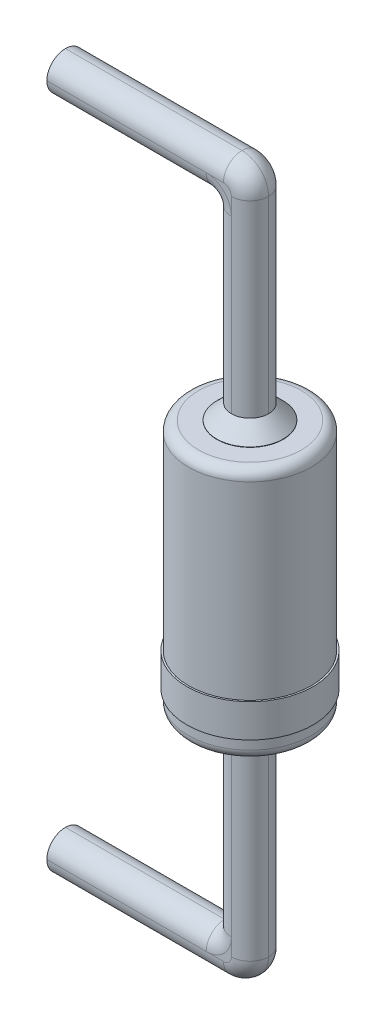
ISO-10303-21;
HEADER;
FILE_DESCRIPTION(('STEP AP214'),'2;1');
FILE_NAME('part.step','',(''),(''),'','','');
FILE_SCHEMA(('AUTOMOTIVE_DESIGN { 1 0 10303 214 1 1 1 1 }'));
ENDSEC;
DATA;
#1=APPLICATION_CONTEXT('core data for automotive mechanical design processes');
#2=APPLICATION_PROTOCOL_DEFINITION('international standard','automotive_design',2000,#1);
#3=PRODUCT_CONTEXT('',#1,'mechanical');
#4=PRODUCT('Part','Part','',(#3));
#5=PRODUCT_RELATED_PRODUCT_CATEGORY('part','',(#4));
#6=PRODUCT_DEFINITION_FORMATION('','',#4);
#7=PRODUCT_DEFINITION_CONTEXT('part definition',#1,'design');
#8=PRODUCT_DEFINITION('design','',#6,#7);
#9=PRODUCT_DEFINITION_SHAPE('','',#8);
#10=(LENGTH_UNIT() NAMED_UNIT(*) SI_UNIT(.MILLI.,.METRE.));
#11=(NAMED_UNIT(*) PLANE_ANGLE_UNIT() SI_UNIT($,.RADIAN.));
#12=(NAMED_UNIT(*) SI_UNIT($,.STERADIAN.) SOLID_ANGLE_UNIT());
#13=UNCERTAINTY_MEASURE_WITH_UNIT(LENGTH_MEASURE(1.E-05),#10,'distance_accuracy_value','');
#14=(GEOMETRIC_REPRESENTATION_CONTEXT(3) GLOBAL_UNCERTAINTY_ASSIGNED_CONTEXT((#13)) GLOBAL_UNIT_ASSIGNED_CONTEXT((#10,
#11,#12)) REPRESENTATION_CONTEXT('',''));
#15=CARTESIAN_POINT('',(0.,0.,0.));
#16=DIRECTION('',(0.,0.,1.));
#17=DIRECTION('',(1.,0.,0.));
#18=AXIS2_PLACEMENT_3D('',#15,#16,#17);
#19=CARTESIAN_POINT('',(0.,0.3,0.));
#20=DIRECTION('',(0.,1.,0.));
#21=DIRECTION('',(0.,0.,1.));
#22=AXIS2_PLACEMENT_3D('',#19,#20,#21);
#23=CYLINDRICAL_SURFACE('',#22,0.95);
#24=CARTESIAN_POINT('',(0.,0.3,0.));
#25=DIRECTION('',(0.,1.,0.));
#26=DIRECTION('',(0.,0.,1.));
#27=AXIS2_PLACEMENT_3D('',#24,#25,#26);
#28=CIRCLE('',#27,0.95);
#29=CARTESIAN_POINT('',(0.,0.3,0.95));
#30=VERTEX_POINT('',#29);
#31=EDGE_CURVE('E11',#30,#30,#28,.T.);
#32=ORIENTED_EDGE('',*,*,#31,.T.);
#33=EDGE_LOOP('',(#32));
#34=FACE_BOUND('',#33,.T.);
#35=CARTESIAN_POINT('',(0.,0.8,0.));
#36=DIRECTION('',(0.,1.,0.));
#37=DIRECTION('',(0.,0.,1.));
#38=AXIS2_PLACEMENT_3D('',#35,#36,#37);
#39=CIRCLE('',#38,0.95);
#40=CARTESIAN_POINT('',(0.,0.8,0.95));
#41=VERTEX_POINT('',#40);
#42=EDGE_CURVE('E45',#41,#41,#39,.T.);
#43=ORIENTED_EDGE('',*,*,#42,.F.);
#44=EDGE_LOOP('',(#43));
#45=FACE_BOUND('',#44,.T.);
#46=ADVANCED_FACE('F42',(#34,#45),#23,.T.);
#47=CARTESIAN_POINT('',(0.,0.3,0.));
#48=DIRECTION('',(0.,1.,0.));
#49=DIRECTION('',(0.,0.,1.));
#50=AXIS2_PLACEMENT_3D('',#47,#48,#49);
#51=PLANE('',#50);
#52=CARTESIAN_POINT('',(0.,0.3,0.));
#53=DIRECTION('',(0.,1.,0.));
#54=DIRECTION('',(0.,0.,1.));
#55=AXIS2_PLACEMENT_3D('',#52,#53,#54);
#56=CIRCLE('',#55,0.9);
#57=CARTESIAN_POINT('',(0.,0.3,0.9));
#58=VERTEX_POINT('',#57);
#59=EDGE_CURVE('E52',#58,#58,#56,.T.);
#60=ORIENTED_EDGE('',*,*,#59,.T.);
#61=EDGE_LOOP('',(#60));
#62=FACE_BOUND('',#61,.T.);
#63=ORIENTED_EDGE('',*,*,#31,.F.);
#64=EDGE_LOOP('',(#63));
#65=FACE_BOUND('',#64,.T.);
#66=ADVANCED_FACE('F60',(#62,#65),#51,.F.);
#67=CARTESIAN_POINT('',(0.,0.8,0.));
#68=DIRECTION('',(0.,1.,0.));
#69=DIRECTION('',(0.,0.,1.));
#70=AXIS2_PLACEMENT_3D('',#67,#68,#69);
#71=PLANE('',#70);
#72=CARTESIAN_POINT('',(0.,0.8,0.));
#73=DIRECTION('',(0.,1.,0.));
#74=DIRECTION('',(0.,0.,1.));
#75=AXIS2_PLACEMENT_3D('',#72,#73,#74);
#76=CIRCLE('',#75,0.9);
#77=CARTESIAN_POINT('',(0.,0.8,0.9));
#78=VERTEX_POINT('',#77);
#79=EDGE_CURVE('E54',#78,#78,#76,.T.);
#80=ORIENTED_EDGE('',*,*,#79,.F.);
#81=EDGE_LOOP('',(#80));
#82=FACE_BOUND('',#81,.T.);
#83=ORIENTED_EDGE('',*,*,#42,.T.);
#84=EDGE_LOOP('',(#83));
#85=FACE_BOUND('',#84,.T.);
#86=ADVANCED_FACE('F66',(#82,#85),#71,.T.);
#87=CARTESIAN_POINT('',(0.,0.3,0.));
#88=DIRECTION('',(0.,1.,0.));
#89=DIRECTION('',(0.,0.,1.));
#90=AXIS2_PLACEMENT_3D('',#87,#88,#89);
#91=CYLINDRICAL_SURFACE('',#90,0.9);
#92=ORIENTED_EDGE('',*,*,#59,.F.);
#93=EDGE_LOOP('',(#92));
#94=FACE_BOUND('',#93,.T.);
#95=ORIENTED_EDGE('',*,*,#79,.T.);
#96=EDGE_LOOP('',(#95));
#97=FACE_BOUND('',#96,.T.);
#98=ADVANCED_FACE('F63',(#94,#97),#91,.F.);
#99=CLOSED_SHELL('',(#46,#66,#86,#98));
#100=MANIFOLD_SOLID_BREP('B2',#99);
#101=CARTESIAN_POINT('',(0.28,-3.46,-0.28));
#102=DIRECTION('',(0.,0.,1.));
#103=DIRECTION('',(1.,0.,0.));
#104=AXIS2_PLACEMENT_3D('',#101,#102,#103);
#105=PLANE('',#104);
#106=CARTESIAN_POINT('',(-0.38,-2.8,-0.28));
#107=DIRECTION('',(0.,0.,-1.));
#108=DIRECTION('',(1.,0.,0.));
#109=AXIS2_PLACEMENT_3D('',#106,#107,#108);
#110=CIRCLE('',#109,0.38);
#111=CARTESIAN_POINT('',(-0.38,-3.18,-0.28));
#112=VERTEX_POINT('',#111);
#113=CARTESIAN_POINT('',(0.,-2.8,-0.28));
#114=VERTEX_POINT('',#113);
#115=EDGE_CURVE('E40',#112,#114,#110,.F.);
#116=ORIENTED_EDGE('',*,*,#115,.T.);
#117=DIRECTION('',(0.,1.,0.));
#118=VECTOR('',#117,1.);
#119=CARTESIAN_POINT('',(0.,-3.46,-0.28));
#120=LINE('',#119,#118);
#121=CARTESIAN_POINT('',(0.,-3.06,-0.28));
#122=VERTEX_POINT('',#121);
#123=EDGE_CURVE('E227',#122,#114,#120,.T.);
#124=ORIENTED_EDGE('',*,*,#123,.F.);
#125=CARTESIAN_POINT('',(-0.12,-3.06,-0.28));
#126=DIRECTION('',(0.,0.,-1.));
#127=DIRECTION('',(1.,0.,0.));
#128=AXIS2_PLACEMENT_3D('',#125,#126,#127);
#129=CIRCLE('',#128,0.12);
#130=CARTESIAN_POINT('',(-0.12,-3.18,-0.28));
#131=VERTEX_POINT('',#130);
#132=EDGE_CURVE('E233',#122,#131,#129,.T.);
#133=ORIENTED_EDGE('',*,*,#132,.T.);
#134=DIRECTION('',(-1.,0.,0.));
#135=VECTOR('',#134,1.);
#136=CARTESIAN_POINT('',(0.28,-3.18,-0.28));
#137=LINE('',#136,#135);
#138=EDGE_CURVE('E125',#112,#131,#137,.F.);
#139=ORIENTED_EDGE('',*,*,#138,.F.);
#140=EDGE_LOOP('',(#116,#124,#133,#139));
#141=FACE_BOUND('',#140,.T.);
#142=ADVANCED_FACE('F115',(#141),#105,.F.);
#143=CARTESIAN_POINT('',(0.28,-3.46,0.28));
#144=DIRECTION('',(0.,0.,-1.));
#145=DIRECTION('',(-1.,0.,0.));
#146=AXIS2_PLACEMENT_3D('',#143,#144,#145);
#147=PLANE('',#146);
#148=CARTESIAN_POINT('',(-0.38,-2.8,0.28));
#149=DIRECTION('',(0.,0.,1.));
#150=DIRECTION('',(-1.,0.,0.));
#151=AXIS2_PLACEMENT_3D('',#148,#149,#150);
#152=CIRCLE('',#151,0.38);
#153=CARTESIAN_POINT('',(0.,-2.8,0.28));
#154=VERTEX_POINT('',#153);
#155=CARTESIAN_POINT('',(-0.38,-3.18,0.28));
#156=VERTEX_POINT('',#155);
#157=EDGE_CURVE('E287',#154,#156,#152,.F.);
#158=ORIENTED_EDGE('',*,*,#157,.T.);
#159=DIRECTION('',(1.,0.,0.));
#160=VECTOR('',#159,1.);
#161=CARTESIAN_POINT('',(-2.78,-3.18,0.28));
#162=LINE('',#161,#160);
#163=CARTESIAN_POINT('',(-0.12,-3.18,0.28));
#164=VERTEX_POINT('',#163);
#165=EDGE_CURVE('E284',#164,#156,#162,.F.);
#166=ORIENTED_EDGE('',*,*,#165,.F.);
#167=CARTESIAN_POINT('',(-0.12,-3.06,0.28));
#168=DIRECTION('',(0.,0.,1.));
#169=DIRECTION('',(-1.,0.,0.));
#170=AXIS2_PLACEMENT_3D('',#167,#168,#169);
#171=CIRCLE('',#170,0.12);
#172=CARTESIAN_POINT('',(0.,-3.06,0.28));
#173=VERTEX_POINT('',#172);
#174=EDGE_CURVE('E279',#164,#173,#171,.T.);
#175=ORIENTED_EDGE('',*,*,#174,.T.);
#176=DIRECTION('',(0.,1.,0.));
#177=VECTOR('',#176,1.);
#178=CARTESIAN_POINT('',(0.,-3.46,0.28));
#179=LINE('',#178,#177);
#180=EDGE_CURVE('E282',#154,#173,#179,.F.);
#181=ORIENTED_EDGE('',*,*,#180,.F.);
#182=EDGE_LOOP('',(#158,#166,#175,#181));
#183=FACE_BOUND('',#182,.T.);
#184=ADVANCED_FACE('F321',(#183),#147,.F.);
#185=CARTESIAN_POINT('',(0.,-0.225,0.));
#186=DIRECTION('',(0.,1.,0.));
#187=DIRECTION('',(0.,0.,-1.));
#188=AXIS2_PLACEMENT_3D('',#185,#186,#187);
#189=CYLINDRICAL_SURFACE('',#188,0.5);
#190=CARTESIAN_POINT('',(0.,-0.00499999999999893,0.));
#191=DIRECTION('',(0.,1.,0.));
#192=DIRECTION('',(0.,0.,1.));
#193=AXIS2_PLACEMENT_3D('',#190,#191,#192);
#194=CIRCLE('',#193,0.5);
#195=CARTESIAN_POINT('',(0.,-0.00499999999999893,0.5));
#196=VERTEX_POINT('',#195);
#197=EDGE_CURVE('E275',#196,#196,#194,.F.);
#198=ORIENTED_EDGE('',*,*,#197,.F.);
#199=EDGE_LOOP('',(#198));
#200=FACE_BOUND('',#199,.T.);
#201=CARTESIAN_POINT('',(0.,0.,0.));
#202=DIRECTION('',(0.,1.,0.));
#203=DIRECTION('',(0.,0.,1.));
#204=AXIS2_PLACEMENT_3D('',#201,#202,#203);
#205=CIRCLE('',#204,0.5);
#206=CARTESIAN_POINT('',(0.,0.,0.5));
#207=VERTEX_POINT('',#206);
#208=EDGE_CURVE('E265',#207,#207,#205,.T.);
#209=ORIENTED_EDGE('',*,*,#208,.F.);
#210=EDGE_LOOP('',(#209));
#211=FACE_BOUND('',#210,.T.);
#212=ADVANCED_FACE('F337',(#200,#211),#189,.T.);
#213=CARTESIAN_POINT('',(0.,0.,0.));
#214=DIRECTION('',(0.,-1.,0.));
#215=DIRECTION('',(0.,0.,1.));
#216=AXIS2_PLACEMENT_3D('',#213,#214,#215);
#217=PLANE('',#216);
#218=ORIENTED_EDGE('',*,*,#208,.T.);
#219=EDGE_LOOP('',(#218));
#220=FACE_BOUND('',#219,.T.);
#221=ADVANCED_FACE('F341',(#220),#217,.F.);
#222=CARTESIAN_POINT('',(0.,-0.225,0.));
#223=DIRECTION('',(0.,1.,0.));
#224=DIRECTION('',(0.,0.,-1.));
#225=AXIS2_PLACEMENT_3D('',#222,#223,#224);
#226=CONICAL_SURFACE('',#225,0.28,0.785398163397447);
#227=ORIENTED_EDGE('',*,*,#197,.T.);
#228=EDGE_LOOP('',(#227));
#229=FACE_BOUND('',#228,.T.);
#230=CARTESIAN_POINT('',(0.,-0.225,0.));
#231=DIRECTION('',(0.,1.,0.));
#232=DIRECTION('',(0.,0.,1.));
#233=AXIS2_PLACEMENT_3D('',#230,#231,#232);
#234=CIRCLE('',#233,0.28);
#235=CARTESIAN_POINT('',(0.,-0.225,0.28));
#236=VERTEX_POINT('',#235);
#237=CARTESIAN_POINT('',(0.28,-0.225,0.));
#238=VERTEX_POINT('',#237);
#239=EDGE_CURVE('E272',#236,#238,#234,.T.);
#240=ORIENTED_EDGE('',*,*,#239,.T.);
#241=CARTESIAN_POINT('',(0.,-0.225,-0.28));
#242=VERTEX_POINT('',#241);
#243=EDGE_CURVE('E276',#238,#242,#234,.T.);
#244=ORIENTED_EDGE('',*,*,#243,.T.);
#245=CARTESIAN_POINT('',(-0.28,-0.225,0.));
#246=VERTEX_POINT('',#245);
#247=EDGE_CURVE('E220',#242,#246,#234,.T.);
#248=ORIENTED_EDGE('',*,*,#247,.T.);
#249=EDGE_CURVE('E267',#246,#236,#234,.T.);
#250=ORIENTED_EDGE('',*,*,#249,.T.);
#251=EDGE_LOOP('',(#240,#244,#248,#250));
#252=FACE_BOUND('',#251,.T.);
#253=ADVANCED_FACE('F314',(#229,#252),#226,.T.);
#254=CARTESIAN_POINT('',(-2.78,-2.9,-0.28));
#255=DIRECTION('',(-1.,0.,0.));
#256=DIRECTION('',(0.,0.,1.));
#257=AXIS2_PLACEMENT_3D('',#254,#255,#256);
#258=PLANE('',#257);
#259=CARTESIAN_POINT('',(-2.78,-3.18,0.));
#260=DIRECTION('',(1.,0.,0.));
#261=DIRECTION('',(0.,0.,1.));
#262=AXIS2_PLACEMENT_3D('',#259,#260,#261);
#263=CIRCLE('',#262,0.28);
#264=CARTESIAN_POINT('',(-2.78,-2.9,0.));
#265=VERTEX_POINT('',#264);
#266=CARTESIAN_POINT('',(-2.78,-3.18,0.28));
#267=VERTEX_POINT('',#266);
#268=EDGE_CURVE('E295',#265,#267,#263,.T.);
#269=ORIENTED_EDGE('',*,*,#268,.F.);
#270=CARTESIAN_POINT('',(-2.78,-3.18,0.));
#271=DIRECTION('',(1.,0.,0.));
#272=DIRECTION('',(0.,0.,1.));
#273=AXIS2_PLACEMENT_3D('',#270,#271,#272);
#274=CIRCLE('',#273,0.28);
#275=CARTESIAN_POINT('',(-2.78,-3.18,-0.28));
#276=VERTEX_POINT('',#275);
#277=EDGE_CURVE('E290',#276,#265,#274,.T.);
#278=ORIENTED_EDGE('',*,*,#277,.F.);
#279=CARTESIAN_POINT('',(-2.78,-3.18,0.));
#280=DIRECTION('',(1.,0.,0.));
#281=DIRECTION('',(0.,0.,1.));
#282=AXIS2_PLACEMENT_3D('',#279,#280,#281);
#283=CIRCLE('',#282,0.28);
#284=CARTESIAN_POINT('',(-2.78,-3.46,0.));
#285=VERTEX_POINT('',#284);
#286=EDGE_CURVE('E293',#285,#276,#283,.T.);
#287=ORIENTED_EDGE('',*,*,#286,.F.);
#288=CARTESIAN_POINT('',(-2.78,-3.18,0.));
#289=DIRECTION('',(1.,0.,0.));
#290=DIRECTION('',(0.,0.,1.));
#291=AXIS2_PLACEMENT_3D('',#288,#289,#290);
#292=CIRCLE('',#291,0.28);
#293=EDGE_CURVE('E234',#267,#285,#292,.T.);
#294=ORIENTED_EDGE('',*,*,#293,.F.);
#295=EDGE_LOOP('',(#269,#278,#287,#294));
#296=FACE_BOUND('',#295,.T.);
#297=ADVANCED_FACE('F307',(#296),#258,.T.);
#298=CARTESIAN_POINT('',(0.,-3.46,0.));
#299=DIRECTION('',(0.,1.,0.));
#300=DIRECTION('',(0.,0.,-1.));
#301=AXIS2_PLACEMENT_3D('',#298,#299,#300);
#302=CYLINDRICAL_SURFACE('',#301,0.28);
#303=DIRECTION('',(0.,1.,0.));
#304=VECTOR('',#303,1.);
#305=CARTESIAN_POINT('',(0.,-3.46,-0.28));
#306=LINE('',#305,#304);
#307=EDGE_CURVE('E213',#114,#242,#306,.T.);
#308=ORIENTED_EDGE('',*,*,#307,.T.);
#309=ORIENTED_EDGE('',*,*,#243,.F.);
#310=DIRECTION('',(0.,1.,0.));
#311=VECTOR('',#310,1.);
#312=CARTESIAN_POINT('',(0.28,-3.46,0.));
#313=LINE('',#312,#311);
#314=CARTESIAN_POINT('',(0.28,-3.06,0.));
#315=VERTEX_POINT('',#314);
#316=EDGE_CURVE('E224',#238,#315,#313,.F.);
#317=ORIENTED_EDGE('',*,*,#316,.T.);
#318=CARTESIAN_POINT('',(0.,-3.06,0.));
#319=DIRECTION('',(0.,1.,0.));
#320=DIRECTION('',(0.,0.,1.));
#321=AXIS2_PLACEMENT_3D('',#318,#319,#320);
#322=CIRCLE('',#321,0.28);
#323=EDGE_CURVE('E119',#315,#122,#322,.T.);
#324=ORIENTED_EDGE('',*,*,#323,.T.);
#325=ORIENTED_EDGE('',*,*,#123,.T.);
#326=EDGE_LOOP('',(#308,#309,#317,#324,#325));
#327=FACE_BOUND('',#326,.T.);
#328=ADVANCED_FACE('F117',(#327),#302,.T.);
#329=CARTESIAN_POINT('',(-0.12,-3.06,0.));
#330=DIRECTION('',(0.,0.,1.));
#331=DIRECTION('',(1.,0.,0.));
#332=AXIS2_PLACEMENT_3D('',#329,#330,#331);
#333=DEGENERATE_TOROIDAL_SURFACE('',#332,0.12,0.28,.T.);
#334=CARTESIAN_POINT('',(-0.12,-3.06,0.));
#335=DIRECTION('',(0.,0.,-1.));
#336=DIRECTION('',(1.,0.,0.));
#337=AXIS2_PLACEMENT_3D('',#334,#335,#336);
#338=CIRCLE('',#337,0.4);
#339=CARTESIAN_POINT('',(-0.12,-3.46,0.));
#340=VERTEX_POINT('',#339);
#341=EDGE_CURVE('E262',#315,#340,#338,.T.);
#342=ORIENTED_EDGE('',*,*,#341,.T.);
#343=CARTESIAN_POINT('',(-0.12,-3.18,0.));
#344=DIRECTION('',(-1.,0.,0.));
#345=DIRECTION('',(0.,0.,-1.));
#346=AXIS2_PLACEMENT_3D('',#343,#344,#345);
#347=CIRCLE('',#346,0.28);
#348=EDGE_CURVE('E214',#340,#131,#347,.F.);
#349=ORIENTED_EDGE('',*,*,#348,.T.);
#350=ORIENTED_EDGE('',*,*,#132,.F.);
#351=ORIENTED_EDGE('',*,*,#323,.F.);
#352=EDGE_LOOP('',(#342,#349,#350,#351));
#353=FACE_BOUND('',#352,.T.);
#354=ADVANCED_FACE('F309',(#353),#333,.T.);
#355=CARTESIAN_POINT('',(0.,-3.46,0.));
#356=DIRECTION('',(0.,1.,0.));
#357=DIRECTION('',(0.,0.,-1.));
#358=AXIS2_PLACEMENT_3D('',#355,#356,#357);
#359=CYLINDRICAL_SURFACE('',#358,0.28);
#360=ORIENTED_EDGE('',*,*,#239,.F.);
#361=DIRECTION('',(0.,1.,0.));
#362=VECTOR('',#361,1.);
#363=CARTESIAN_POINT('',(0.,-3.46,0.28));
#364=LINE('',#363,#362);
#365=EDGE_CURVE('E168',#236,#154,#364,.F.);
#366=ORIENTED_EDGE('',*,*,#365,.T.);
#367=ORIENTED_EDGE('',*,*,#180,.T.);
#368=CARTESIAN_POINT('',(0.,-3.06,0.));
#369=DIRECTION('',(0.,1.,0.));
#370=DIRECTION('',(0.,0.,1.));
#371=AXIS2_PLACEMENT_3D('',#368,#369,#370);
#372=CIRCLE('',#371,0.28);
#373=EDGE_CURVE('E160',#173,#315,#372,.T.);
#374=ORIENTED_EDGE('',*,*,#373,.T.);
#375=ORIENTED_EDGE('',*,*,#316,.F.);
#376=EDGE_LOOP('',(#360,#366,#367,#374,#375));
#377=FACE_BOUND('',#376,.T.);
#378=ADVANCED_FACE('F311',(#377),#359,.T.);
#379=CARTESIAN_POINT('',(0.,-3.46,0.));
#380=DIRECTION('',(0.,1.,0.));
#381=DIRECTION('',(0.,0.,-1.));
#382=AXIS2_PLACEMENT_3D('',#379,#380,#381);
#383=CYLINDRICAL_SURFACE('',#382,0.28);
#384=CARTESIAN_POINT('',(0.,-2.8,0.));
#385=DIRECTION('',(0.,1.,0.));
#386=DIRECTION('',(0.,0.,1.));
#387=AXIS2_PLACEMENT_3D('',#384,#385,#386);
#388=CIRCLE('',#387,0.28);
#389=CARTESIAN_POINT('',(-0.28,-2.8,0.));
#390=VERTEX_POINT('',#389);
#391=EDGE_CURVE('E205',#114,#390,#388,.T.);
#392=ORIENTED_EDGE('',*,*,#391,.T.);
#393=DIRECTION('',(0.,1.,0.));
#394=VECTOR('',#393,1.);
#395=CARTESIAN_POINT('',(-0.28,-3.46,0.));
#396=LINE('',#395,#394);
#397=EDGE_CURVE('E257',#390,#246,#396,.T.);
#398=ORIENTED_EDGE('',*,*,#397,.T.);
#399=ORIENTED_EDGE('',*,*,#247,.F.);
#400=ORIENTED_EDGE('',*,*,#307,.F.);
#401=EDGE_LOOP('',(#392,#398,#399,#400));
#402=FACE_BOUND('',#401,.T.);
#403=ADVANCED_FACE('F218',(#402),#383,.T.);
#404=CARTESIAN_POINT('',(-0.38,-2.8,0.));
#405=DIRECTION('',(0.,0.,1.));
#406=DIRECTION('',(1.,0.,0.));
#407=AXIS2_PLACEMENT_3D('',#404,#405,#406);
#408=TOROIDAL_SURFACE('',#407,0.38,0.28);
#409=ORIENTED_EDGE('',*,*,#115,.F.);
#410=CARTESIAN_POINT('',(-0.38,-3.18,0.));
#411=DIRECTION('',(-1.,0.,0.));
#412=DIRECTION('',(0.,0.,-1.));
#413=AXIS2_PLACEMENT_3D('',#410,#411,#412);
#414=CIRCLE('',#413,0.28);
#415=CARTESIAN_POINT('',(-0.38,-2.9,0.));
#416=VERTEX_POINT('',#415);
#417=EDGE_CURVE('E254',#112,#416,#414,.F.);
#418=ORIENTED_EDGE('',*,*,#417,.T.);
#419=CARTESIAN_POINT('',(-0.38,-2.8,0.));
#420=DIRECTION('',(0.,0.,-1.));
#421=DIRECTION('',(1.,0.,0.));
#422=AXIS2_PLACEMENT_3D('',#419,#420,#421);
#423=CIRCLE('',#422,0.1);
#424=EDGE_CURVE('E210',#416,#390,#423,.F.);
#425=ORIENTED_EDGE('',*,*,#424,.T.);
#426=ORIENTED_EDGE('',*,*,#391,.F.);
#427=EDGE_LOOP('',(#409,#418,#425,#426));
#428=FACE_BOUND('',#427,.T.);
#429=ADVANCED_FACE('F207',(#428),#408,.T.);
#430=CARTESIAN_POINT('',(-0.28,-3.18,0.));
#431=DIRECTION('',(1.,0.,0.));
#432=DIRECTION('',(0.,0.,-1.));
#433=AXIS2_PLACEMENT_3D('',#430,#431,#432);
#434=CYLINDRICAL_SURFACE('',#433,0.28);
#435=ORIENTED_EDGE('',*,*,#348,.F.);
#436=DIRECTION('',(-1.,0.,0.));
#437=VECTOR('',#436,1.);
#438=CARTESIAN_POINT('',(-2.78,-3.46,0.));
#439=LINE('',#438,#437);
#440=EDGE_CURVE('E251',#340,#285,#439,.T.);
#441=ORIENTED_EDGE('',*,*,#440,.T.);
#442=ORIENTED_EDGE('',*,*,#286,.T.);
#443=DIRECTION('',(-1.,0.,0.));
#444=VECTOR('',#443,1.);
#445=CARTESIAN_POINT('',(0.28,-3.18,-0.28));
#446=LINE('',#445,#444);
#447=EDGE_CURVE('E134',#276,#112,#446,.F.);
#448=ORIENTED_EDGE('',*,*,#447,.T.);
#449=ORIENTED_EDGE('',*,*,#138,.T.);
#450=EDGE_LOOP('',(#435,#441,#442,#448,#449));
#451=FACE_BOUND('',#450,.T.);
#452=ADVANCED_FACE('F308',(#451),#434,.T.);
#453=CARTESIAN_POINT('',(-0.12,-3.06,0.));
#454=DIRECTION('',(0.,0.,-1.));
#455=DIRECTION('',(-1.,0.,0.));
#456=AXIS2_PLACEMENT_3D('',#453,#454,#455);
#457=DEGENERATE_TOROIDAL_SURFACE('',#456,0.12,0.28,.T.);
#458=ORIENTED_EDGE('',*,*,#373,.F.);
#459=ORIENTED_EDGE('',*,*,#174,.F.);
#460=CARTESIAN_POINT('',(-0.12,-3.18,0.));
#461=DIRECTION('',(-1.,0.,0.));
#462=DIRECTION('',(0.,0.,-1.));
#463=AXIS2_PLACEMENT_3D('',#460,#461,#462);
#464=CIRCLE('',#463,0.28);
#465=EDGE_CURVE('E152',#164,#340,#464,.F.);
#466=ORIENTED_EDGE('',*,*,#465,.T.);
#467=ORIENTED_EDGE('',*,*,#341,.F.);
#468=EDGE_LOOP('',(#458,#459,#466,#467));
#469=FACE_BOUND('',#468,.T.);
#470=ADVANCED_FACE('F322',(#469),#457,.T.);
#471=CARTESIAN_POINT('',(0.,-3.46,0.));
#472=DIRECTION('',(0.,1.,0.));
#473=DIRECTION('',(0.,0.,-1.));
#474=AXIS2_PLACEMENT_3D('',#471,#472,#473);
#475=CYLINDRICAL_SURFACE('',#474,0.28);
#476=ORIENTED_EDGE('',*,*,#249,.F.);
#477=ORIENTED_EDGE('',*,*,#397,.F.);
#478=CARTESIAN_POINT('',(0.,-2.8,0.));
#479=DIRECTION('',(0.,1.,0.));
#480=DIRECTION('',(0.,0.,1.));
#481=AXIS2_PLACEMENT_3D('',#478,#479,#480);
#482=CIRCLE('',#481,0.28);
#483=EDGE_CURVE('E248',#390,#154,#482,.T.);
#484=ORIENTED_EDGE('',*,*,#483,.T.);
#485=ORIENTED_EDGE('',*,*,#365,.F.);
#486=EDGE_LOOP('',(#476,#477,#484,#485));
#487=FACE_BOUND('',#486,.T.);
#488=ADVANCED_FACE('F315',(#487),#475,.T.);
#489=CARTESIAN_POINT('',(-2.78,-3.18,0.));
#490=DIRECTION('',(1.,0.,0.));
#491=DIRECTION('',(0.,0.,-1.));
#492=AXIS2_PLACEMENT_3D('',#489,#490,#491);
#493=CYLINDRICAL_SURFACE('',#492,0.28);
#494=ORIENTED_EDGE('',*,*,#447,.F.);
#495=ORIENTED_EDGE('',*,*,#277,.T.);
#496=DIRECTION('',(1.,0.,0.));
#497=VECTOR('',#496,1.);
#498=CARTESIAN_POINT('',(-2.78,-2.9,0.));
#499=LINE('',#498,#497);
#500=EDGE_CURVE('E245',#265,#416,#499,.T.);
#501=ORIENTED_EDGE('',*,*,#500,.T.);
#502=ORIENTED_EDGE('',*,*,#417,.F.);
#503=EDGE_LOOP('',(#494,#495,#501,#502));
#504=FACE_BOUND('',#503,.T.);
#505=ADVANCED_FACE('F329',(#504),#493,.T.);
#506=CARTESIAN_POINT('',(-0.28,-3.18,0.));
#507=DIRECTION('',(-1.,0.,0.));
#508=DIRECTION('',(0.,0.,1.));
#509=AXIS2_PLACEMENT_3D('',#506,#507,#508);
#510=CYLINDRICAL_SURFACE('',#509,0.28);
#511=ORIENTED_EDGE('',*,*,#440,.F.);
#512=ORIENTED_EDGE('',*,*,#465,.F.);
#513=ORIENTED_EDGE('',*,*,#165,.T.);
#514=DIRECTION('',(1.,0.,0.));
#515=VECTOR('',#514,1.);
#516=CARTESIAN_POINT('',(-2.78,-3.18,0.28));
#517=LINE('',#516,#515);
#518=EDGE_CURVE('E243',#156,#267,#517,.F.);
#519=ORIENTED_EDGE('',*,*,#518,.T.);
#520=ORIENTED_EDGE('',*,*,#293,.T.);
#521=EDGE_LOOP('',(#511,#512,#513,#519,#520));
#522=FACE_BOUND('',#521,.T.);
#523=ADVANCED_FACE('F302',(#522),#510,.T.);
#524=CARTESIAN_POINT('',(-0.38,-2.8,0.));
#525=DIRECTION('',(0.,0.,-1.));
#526=DIRECTION('',(-1.,0.,0.));
#527=AXIS2_PLACEMENT_3D('',#524,#525,#526);
#528=TOROIDAL_SURFACE('',#527,0.38,0.28);
#529=ORIENTED_EDGE('',*,*,#483,.F.);
#530=ORIENTED_EDGE('',*,*,#424,.F.);
#531=CARTESIAN_POINT('',(-0.38,-3.18,0.));
#532=DIRECTION('',(-1.,0.,0.));
#533=DIRECTION('',(0.,0.,-1.));
#534=AXIS2_PLACEMENT_3D('',#531,#532,#533);
#535=CIRCLE('',#534,0.28);
#536=EDGE_CURVE('E241',#416,#156,#535,.F.);
#537=ORIENTED_EDGE('',*,*,#536,.T.);
#538=ORIENTED_EDGE('',*,*,#157,.F.);
#539=EDGE_LOOP('',(#529,#530,#537,#538));
#540=FACE_BOUND('',#539,.T.);
#541=ADVANCED_FACE('F318',(#540),#528,.T.);
#542=CARTESIAN_POINT('',(0.28,-3.18,0.));
#543=DIRECTION('',(1.,0.,0.));
#544=DIRECTION('',(0.,0.,-1.));
#545=AXIS2_PLACEMENT_3D('',#542,#543,#544);
#546=CYLINDRICAL_SURFACE('',#545,0.28);
#547=ORIENTED_EDGE('',*,*,#268,.T.);
#548=ORIENTED_EDGE('',*,*,#518,.F.);
#549=ORIENTED_EDGE('',*,*,#536,.F.);
#550=ORIENTED_EDGE('',*,*,#500,.F.);
#551=EDGE_LOOP('',(#547,#548,#549,#550));
#552=FACE_BOUND('',#551,.T.);
#553=ADVANCED_FACE('F350',(#552),#546,.T.);
#554=CLOSED_SHELL('',(#142,#184,#212,#221,#253,#297,#328,#354,#378,#403,#429,#452,#470,#488,
#505,#523,#541,#553));
#555=MANIFOLD_SOLID_BREP('B6',#554);
#556=CARTESIAN_POINT('',(0.28,7.26,-0.28));
#557=DIRECTION('',(0.,0.,1.));
#558=DIRECTION('',(1.,0.,0.));
#559=AXIS2_PLACEMENT_3D('',#556,#557,#558);
#560=PLANE('',#559);
#561=CARTESIAN_POINT('',(-0.38,6.6,-0.28));
#562=DIRECTION('',(0.,0.,1.));
#563=DIRECTION('',(1.,0.,0.));
#564=AXIS2_PLACEMENT_3D('',#561,#562,#563);
#565=CIRCLE('',#564,0.38);
#566=CARTESIAN_POINT('',(-0.38,6.98,-0.28));
#567=VERTEX_POINT('',#566);
#568=CARTESIAN_POINT('',(0.,6.6,-0.28));
#569=VERTEX_POINT('',#568);
#570=EDGE_CURVE('E113',#567,#569,#565,.F.);
#571=ORIENTED_EDGE('',*,*,#570,.F.);
#572=DIRECTION('',(-1.,0.,0.));
#573=VECTOR('',#572,1.);
#574=CARTESIAN_POINT('',(0.28,6.98,-0.28));
#575=LINE('',#574,#573);
#576=CARTESIAN_POINT('',(-0.12,6.98,-0.28));
#577=VERTEX_POINT('',#576);
#578=EDGE_CURVE('E537',#567,#577,#575,.F.);
#579=ORIENTED_EDGE('',*,*,#578,.T.);
#580=CARTESIAN_POINT('',(-0.12,6.86,-0.28));
#581=DIRECTION('',(0.,0.,1.));
#582=DIRECTION('',(1.,0.,0.));
#583=AXIS2_PLACEMENT_3D('',#580,#581,#582);
#584=CIRCLE('',#583,0.12);
#585=CARTESIAN_POINT('',(0.,6.86,-0.28));
#586=VERTEX_POINT('',#585);
#587=EDGE_CURVE('E619',#586,#577,#584,.T.);
#588=ORIENTED_EDGE('',*,*,#587,.F.);
#589=DIRECTION('',(0.,-1.,0.));
#590=VECTOR('',#589,1.);
#591=CARTESIAN_POINT('',(0.,7.26,-0.28));
#592=LINE('',#591,#590);
#593=EDGE_CURVE('E617',#586,#569,#592,.T.);
#594=ORIENTED_EDGE('',*,*,#593,.T.);
#595=EDGE_LOOP('',(#571,#579,#588,#594));
#596=FACE_BOUND('',#595,.T.);
#597=ADVANCED_FACE('F527',(#596),#560,.F.);
#598=CARTESIAN_POINT('',(0.28,7.26,0.28));
#599=DIRECTION('',(0.,0.,-1.));
#600=DIRECTION('',(-1.,0.,0.));
#601=AXIS2_PLACEMENT_3D('',#598,#599,#600);
#602=PLANE('',#601);
#603=CARTESIAN_POINT('',(-0.38,6.6,0.28));
#604=DIRECTION('',(0.,0.,-1.));
#605=DIRECTION('',(-1.,0.,0.));
#606=AXIS2_PLACEMENT_3D('',#603,#604,#605);
#607=CIRCLE('',#606,0.38);
#608=CARTESIAN_POINT('',(0.,6.6,0.28));
#609=VERTEX_POINT('',#608);
#610=CARTESIAN_POINT('',(-0.38,6.98,0.28));
#611=VERTEX_POINT('',#610);
#612=EDGE_CURVE('E703',#609,#611,#607,.F.);
#613=ORIENTED_EDGE('',*,*,#612,.F.);
#614=DIRECTION('',(0.,-1.,0.));
#615=VECTOR('',#614,1.);
#616=CARTESIAN_POINT('',(0.,7.26,0.28));
#617=LINE('',#616,#615);
#618=CARTESIAN_POINT('',(0.,6.86,0.28));
#619=VERTEX_POINT('',#618);
#620=EDGE_CURVE('E699',#609,#619,#617,.F.);
#621=ORIENTED_EDGE('',*,*,#620,.T.);
#622=CARTESIAN_POINT('',(-0.12,6.86,0.28));
#623=DIRECTION('',(0.,0.,-1.));
#624=DIRECTION('',(-1.,0.,0.));
#625=AXIS2_PLACEMENT_3D('',#622,#623,#624);
#626=CIRCLE('',#625,0.12);
#627=CARTESIAN_POINT('',(-0.12,6.98,0.28));
#628=VERTEX_POINT('',#627);
#629=EDGE_CURVE('E696',#628,#619,#626,.T.);
#630=ORIENTED_EDGE('',*,*,#629,.F.);
#631=DIRECTION('',(1.,0.,0.));
#632=VECTOR('',#631,1.);
#633=CARTESIAN_POINT('',(-2.78,6.98,0.28));
#634=LINE('',#633,#632);
#635=EDGE_CURVE('E701',#628,#611,#634,.F.);
#636=ORIENTED_EDGE('',*,*,#635,.T.);
#637=EDGE_LOOP('',(#613,#621,#630,#636));
#638=FACE_BOUND('',#637,.T.);
#639=ADVANCED_FACE('F725',(#638),#602,.F.);
#640=CARTESIAN_POINT('',(0.,4.025,0.));
#641=DIRECTION('',(0.,-1.,0.));
#642=DIRECTION('',(0.,0.,-1.));
#643=AXIS2_PLACEMENT_3D('',#640,#641,#642);
#644=CYLINDRICAL_SURFACE('',#643,0.5);
#645=CARTESIAN_POINT('',(0.,3.805,0.));
#646=DIRECTION('',(0.,1.,0.));
#647=DIRECTION('',(0.,0.,1.));
#648=AXIS2_PLACEMENT_3D('',#645,#646,#647);
#649=CIRCLE('',#648,0.5);
#650=CARTESIAN_POINT('',(0.,3.805,0.5));
#651=VERTEX_POINT('',#650);
#652=EDGE_CURVE('E693',#651,#651,#649,.F.);
#653=ORIENTED_EDGE('',*,*,#652,.T.);
#654=EDGE_LOOP('',(#653));
#655=FACE_BOUND('',#654,.T.);
#656=CARTESIAN_POINT('',(0.,3.8,0.));
#657=DIRECTION('',(0.,1.,0.));
#658=DIRECTION('',(0.,0.,1.));
#659=AXIS2_PLACEMENT_3D('',#656,#657,#658);
#660=CIRCLE('',#659,0.5);
#661=CARTESIAN_POINT('',(0.,3.8,0.5));
#662=VERTEX_POINT('',#661);
#663=EDGE_CURVE('E683',#662,#662,#660,.T.);
#664=ORIENTED_EDGE('',*,*,#663,.T.);
#665=EDGE_LOOP('',(#664));
#666=FACE_BOUND('',#665,.T.);
#667=ADVANCED_FACE('F741',(#655,#666),#644,.T.);
#668=CARTESIAN_POINT('',(0.,3.8,0.));
#669=DIRECTION('',(0.,1.,0.));
#670=DIRECTION('',(0.,0.,1.));
#671=AXIS2_PLACEMENT_3D('',#668,#669,#670);
#672=PLANE('',#671);
#673=ORIENTED_EDGE('',*,*,#663,.F.);
#674=EDGE_LOOP('',(#673));
#675=FACE_BOUND('',#674,.T.);
#676=ADVANCED_FACE('F733',(#675),#672,.F.);
#677=CARTESIAN_POINT('',(0.,4.025,0.));
#678=DIRECTION('',(0.,-1.,0.));
#679=DIRECTION('',(0.,0.,-1.));
#680=AXIS2_PLACEMENT_3D('',#677,#678,#679);
#681=CONICAL_SURFACE('',#680,0.28,0.785398163397447);
#682=ORIENTED_EDGE('',*,*,#652,.F.);
#683=EDGE_LOOP('',(#682));
#684=FACE_BOUND('',#683,.T.);
#685=CARTESIAN_POINT('',(0.,4.025,0.));
#686=DIRECTION('',(0.,1.,0.));
#687=DIRECTION('',(0.,0.,1.));
#688=AXIS2_PLACEMENT_3D('',#685,#686,#687);
#689=CIRCLE('',#688,0.28);
#690=CARTESIAN_POINT('',(0.,4.025,0.28));
#691=VERTEX_POINT('',#690);
#692=CARTESIAN_POINT('',(0.28,4.025,0.));
#693=VERTEX_POINT('',#692);
#694=EDGE_CURVE('E579',#691,#693,#689,.T.);
#695=ORIENTED_EDGE('',*,*,#694,.F.);
#696=CARTESIAN_POINT('',(-0.28,4.025,0.));
#697=VERTEX_POINT('',#696);
#698=EDGE_CURVE('E685',#697,#691,#689,.T.);
#699=ORIENTED_EDGE('',*,*,#698,.F.);
#700=CARTESIAN_POINT('',(0.,4.025,-0.28));
#701=VERTEX_POINT('',#700);
#702=EDGE_CURVE('E690',#701,#697,#689,.T.);
#703=ORIENTED_EDGE('',*,*,#702,.F.);
#704=EDGE_CURVE('E625',#693,#701,#689,.T.);
#705=ORIENTED_EDGE('',*,*,#704,.F.);
#706=EDGE_LOOP('',(#695,#699,#703,#705));
#707=FACE_BOUND('',#706,.T.);
#708=ADVANCED_FACE('F731',(#684,#707),#681,.T.);
#709=CARTESIAN_POINT('',(-2.78,6.7,-0.28));
#710=DIRECTION('',(-1.,0.,0.));
#711=DIRECTION('',(0.,0.,1.));
#712=AXIS2_PLACEMENT_3D('',#709,#710,#711);
#713=PLANE('',#712);
#714=CARTESIAN_POINT('',(-2.78,6.98,0.));
#715=DIRECTION('',(-1.,0.,0.));
#716=DIRECTION('',(0.,0.,1.));
#717=AXIS2_PLACEMENT_3D('',#714,#715,#716);
#718=CIRCLE('',#717,0.28);
#719=CARTESIAN_POINT('',(-2.78,6.7,0.));
#720=VERTEX_POINT('',#719);
#721=CARTESIAN_POINT('',(-2.78,6.98,0.28));
#722=VERTEX_POINT('',#721);
#723=EDGE_CURVE('E710',#720,#722,#718,.T.);
#724=ORIENTED_EDGE('',*,*,#723,.T.);
#725=CARTESIAN_POINT('',(-2.78,6.98,0.));
#726=DIRECTION('',(-1.,0.,0.));
#727=DIRECTION('',(0.,0.,1.));
#728=AXIS2_PLACEMENT_3D('',#725,#726,#727);
#729=CIRCLE('',#728,0.28);
#730=CARTESIAN_POINT('',(-2.78,7.26,0.));
#731=VERTEX_POINT('',#730);
#732=EDGE_CURVE('E620',#722,#731,#729,.T.);
#733=ORIENTED_EDGE('',*,*,#732,.T.);
#734=CARTESIAN_POINT('',(-2.78,6.98,0.));
#735=DIRECTION('',(-1.,0.,0.));
#736=DIRECTION('',(0.,0.,1.));
#737=AXIS2_PLACEMENT_3D('',#734,#735,#736);
#738=CIRCLE('',#737,0.28);
#739=CARTESIAN_POINT('',(-2.78,6.98,-0.28));
#740=VERTEX_POINT('',#739);
#741=EDGE_CURVE('E708',#731,#740,#738,.T.);
#742=ORIENTED_EDGE('',*,*,#741,.T.);
#743=CARTESIAN_POINT('',(-2.78,6.98,0.));
#744=DIRECTION('',(-1.,0.,0.));
#745=DIRECTION('',(0.,0.,1.));
#746=AXIS2_PLACEMENT_3D('',#743,#744,#745);
#747=CIRCLE('',#746,0.28);
#748=EDGE_CURVE('E706',#740,#720,#747,.T.);
#749=ORIENTED_EDGE('',*,*,#748,.T.);
#750=EDGE_LOOP('',(#724,#733,#742,#749));
#751=FACE_BOUND('',#750,.T.);
#752=ADVANCED_FACE('F715',(#751),#713,.T.);
#753=CARTESIAN_POINT('',(0.,7.26,0.));
#754=DIRECTION('',(0.,-1.,0.));
#755=DIRECTION('',(0.,0.,-1.));
#756=AXIS2_PLACEMENT_3D('',#753,#754,#755);
#757=CYLINDRICAL_SURFACE('',#756,0.28);
#758=DIRECTION('',(0.,-1.,0.));
#759=VECTOR('',#758,1.);
#760=CARTESIAN_POINT('',(0.,7.26,-0.28));
#761=LINE('',#760,#759);
#762=EDGE_CURVE('E623',#569,#701,#761,.T.);
#763=ORIENTED_EDGE('',*,*,#762,.F.);
#764=ORIENTED_EDGE('',*,*,#593,.F.);
#765=CARTESIAN_POINT('',(0.,6.86,0.));
#766=DIRECTION('',(0.,1.,0.));
#767=DIRECTION('',(0.,0.,1.));
#768=AXIS2_PLACEMENT_3D('',#765,#766,#767);
#769=CIRCLE('',#768,0.28);
#770=CARTESIAN_POINT('',(0.28,6.86,0.));
#771=VERTEX_POINT('',#770);
#772=EDGE_CURVE('E531',#771,#586,#769,.T.);
#773=ORIENTED_EDGE('',*,*,#772,.F.);
#774=DIRECTION('',(0.,-1.,0.));
#775=VECTOR('',#774,1.);
#776=CARTESIAN_POINT('',(0.28,7.26,0.));
#777=LINE('',#776,#775);
#778=EDGE_CURVE('E629',#693,#771,#777,.F.);
#779=ORIENTED_EDGE('',*,*,#778,.F.);
#780=ORIENTED_EDGE('',*,*,#704,.T.);
#781=EDGE_LOOP('',(#763,#764,#773,#779,#780));
#782=FACE_BOUND('',#781,.T.);
#783=ADVANCED_FACE('F529',(#782),#757,.T.);
#784=CARTESIAN_POINT('',(-0.12,6.86,0.));
#785=DIRECTION('',(0.,0.,1.));
#786=DIRECTION('',(1.,0.,0.));
#787=AXIS2_PLACEMENT_3D('',#784,#785,#786);
#788=DEGENERATE_TOROIDAL_SURFACE('',#787,0.12,0.28,.T.);
#789=CARTESIAN_POINT('',(-0.12,6.86,0.));
#790=DIRECTION('',(0.,0.,1.));
#791=DIRECTION('',(1.,0.,0.));
#792=AXIS2_PLACEMENT_3D('',#789,#790,#791);
#793=CIRCLE('',#792,0.4);
#794=CARTESIAN_POINT('',(-0.12,7.26,0.));
#795=VERTEX_POINT('',#794);
#796=EDGE_CURVE('E680',#771,#795,#793,.T.);
#797=ORIENTED_EDGE('',*,*,#796,.F.);
#798=ORIENTED_EDGE('',*,*,#772,.T.);
#799=ORIENTED_EDGE('',*,*,#587,.T.);
#800=CARTESIAN_POINT('',(-0.12,6.98,0.));
#801=DIRECTION('',(1.,0.,0.));
#802=DIRECTION('',(0.,0.,-1.));
#803=AXIS2_PLACEMENT_3D('',#800,#801,#802);
#804=CIRCLE('',#803,0.28);
#805=EDGE_CURVE('E564',#795,#577,#804,.F.);
#806=ORIENTED_EDGE('',*,*,#805,.F.);
#807=EDGE_LOOP('',(#797,#798,#799,#806));
#808=FACE_BOUND('',#807,.T.);
#809=ADVANCED_FACE('F798',(#808),#788,.T.);
#810=CARTESIAN_POINT('',(0.,7.26,0.));
#811=DIRECTION('',(0.,-1.,0.));
#812=DIRECTION('',(0.,0.,-1.));
#813=AXIS2_PLACEMENT_3D('',#810,#811,#812);
#814=CYLINDRICAL_SURFACE('',#813,0.28);
#815=ORIENTED_EDGE('',*,*,#694,.T.);
#816=ORIENTED_EDGE('',*,*,#778,.T.);
#817=CARTESIAN_POINT('',(0.,6.86,0.));
#818=DIRECTION('',(0.,1.,0.));
#819=DIRECTION('',(0.,0.,1.));
#820=AXIS2_PLACEMENT_3D('',#817,#818,#819);
#821=CIRCLE('',#820,0.28);
#822=EDGE_CURVE('E675',#619,#771,#821,.T.);
#823=ORIENTED_EDGE('',*,*,#822,.F.);
#824=ORIENTED_EDGE('',*,*,#620,.F.);
#825=DIRECTION('',(0.,-1.,0.));
#826=VECTOR('',#825,1.);
#827=CARTESIAN_POINT('',(0.,7.26,0.28));
#828=LINE('',#827,#826);
#829=EDGE_CURVE('E672',#691,#609,#828,.F.);
#830=ORIENTED_EDGE('',*,*,#829,.F.);
#831=EDGE_LOOP('',(#815,#816,#823,#824,#830));
#832=FACE_BOUND('',#831,.T.);
#833=ADVANCED_FACE('F728',(#832),#814,.T.);
#834=CARTESIAN_POINT('',(0.,7.26,0.));
#835=DIRECTION('',(0.,-1.,0.));
#836=DIRECTION('',(0.,0.,-1.));
#837=AXIS2_PLACEMENT_3D('',#834,#835,#836);
#838=CYLINDRICAL_SURFACE('',#837,0.28);
#839=CARTESIAN_POINT('',(0.,6.6,0.));
#840=DIRECTION('',(0.,1.,0.));
#841=DIRECTION('',(0.,0.,1.));
#842=AXIS2_PLACEMENT_3D('',#839,#840,#841);
#843=CIRCLE('',#842,0.28);
#844=CARTESIAN_POINT('',(-0.28,6.6,0.));
#845=VERTEX_POINT('',#844);
#846=EDGE_CURVE('E630',#569,#845,#843,.T.);
#847=ORIENTED_EDGE('',*,*,#846,.F.);
#848=ORIENTED_EDGE('',*,*,#762,.T.);
#849=ORIENTED_EDGE('',*,*,#702,.T.);
#850=DIRECTION('',(0.,-1.,0.));
#851=VECTOR('',#850,1.);
#852=CARTESIAN_POINT('',(-0.28,7.26,0.));
#853=LINE('',#852,#851);
#854=EDGE_CURVE('E635',#845,#697,#853,.T.);
#855=ORIENTED_EDGE('',*,*,#854,.F.);
#856=EDGE_LOOP('',(#847,#848,#849,#855));
#857=FACE_BOUND('',#856,.T.);
#858=ADVANCED_FACE('F633',(#857),#838,.T.);
#859=CARTESIAN_POINT('',(-0.38,6.6,0.));
#860=DIRECTION('',(0.,0.,1.));
#861=DIRECTION('',(1.,0.,0.));
#862=AXIS2_PLACEMENT_3D('',#859,#860,#861);
#863=TOROIDAL_SURFACE('',#862,0.38,0.28);
#864=ORIENTED_EDGE('',*,*,#570,.T.);
#865=ORIENTED_EDGE('',*,*,#846,.T.);
#866=CARTESIAN_POINT('',(-0.38,6.6,0.));
#867=DIRECTION('',(0.,0.,1.));
#868=DIRECTION('',(1.,0.,0.));
#869=AXIS2_PLACEMENT_3D('',#866,#867,#868);
#870=CIRCLE('',#869,0.1);
#871=CARTESIAN_POINT('',(-0.38,6.7,0.));
#872=VERTEX_POINT('',#871);
#873=EDGE_CURVE('E643',#872,#845,#870,.F.);
#874=ORIENTED_EDGE('',*,*,#873,.F.);
#875=CARTESIAN_POINT('',(-0.38,6.98,0.));
#876=DIRECTION('',(1.,0.,0.));
#877=DIRECTION('',(0.,0.,-1.));
#878=AXIS2_PLACEMENT_3D('',#875,#876,#877);
#879=CIRCLE('',#878,0.28);
#880=EDGE_CURVE('E640',#567,#872,#879,.F.);
#881=ORIENTED_EDGE('',*,*,#880,.F.);
#882=EDGE_LOOP('',(#864,#865,#874,#881));
#883=FACE_BOUND('',#882,.T.);
#884=ADVANCED_FACE('F639',(#883),#863,.T.);
#885=CARTESIAN_POINT('',(-0.28,6.98,0.));
#886=DIRECTION('',(1.,0.,0.));
#887=DIRECTION('',(0.,0.,-1.));
#888=AXIS2_PLACEMENT_3D('',#885,#886,#887);
#889=CYLINDRICAL_SURFACE('',#888,0.28);
#890=ORIENTED_EDGE('',*,*,#805,.T.);
#891=ORIENTED_EDGE('',*,*,#578,.F.);
#892=DIRECTION('',(-1.,0.,0.));
#893=VECTOR('',#892,1.);
#894=CARTESIAN_POINT('',(0.28,6.98,-0.28));
#895=LINE('',#894,#893);
#896=EDGE_CURVE('E546',#740,#567,#895,.F.);
#897=ORIENTED_EDGE('',*,*,#896,.F.);
#898=ORIENTED_EDGE('',*,*,#741,.F.);
#899=DIRECTION('',(-1.,0.,0.));
#900=VECTOR('',#899,1.);
#901=CARTESIAN_POINT('',(-2.78,7.26,0.));
#902=LINE('',#901,#900);
#903=EDGE_CURVE('E666',#795,#731,#902,.T.);
#904=ORIENTED_EDGE('',*,*,#903,.F.);
#905=EDGE_LOOP('',(#890,#891,#897,#898,#904));
#906=FACE_BOUND('',#905,.T.);
#907=ADVANCED_FACE('F648',(#906),#889,.T.);
#908=CARTESIAN_POINT('',(-0.12,6.86,0.));
#909=DIRECTION('',(0.,0.,-1.));
#910=DIRECTION('',(-1.,0.,0.));
#911=AXIS2_PLACEMENT_3D('',#908,#909,#910);
#912=DEGENERATE_TOROIDAL_SURFACE('',#911,0.12,0.28,.T.);
#913=ORIENTED_EDGE('',*,*,#822,.T.);
#914=ORIENTED_EDGE('',*,*,#796,.T.);
#915=CARTESIAN_POINT('',(-0.12,6.98,0.));
#916=DIRECTION('',(1.,0.,0.));
#917=DIRECTION('',(0.,0.,-1.));
#918=AXIS2_PLACEMENT_3D('',#915,#916,#917);
#919=CIRCLE('',#918,0.28);
#920=EDGE_CURVE('E663',#628,#795,#919,.F.);
#921=ORIENTED_EDGE('',*,*,#920,.F.);
#922=ORIENTED_EDGE('',*,*,#629,.T.);
#923=EDGE_LOOP('',(#913,#914,#921,#922));
#924=FACE_BOUND('',#923,.T.);
#925=ADVANCED_FACE('F721',(#924),#912,.T.);
#926=CARTESIAN_POINT('',(0.,7.26,0.));
#927=DIRECTION('',(0.,-1.,0.));
#928=DIRECTION('',(0.,0.,-1.));
#929=AXIS2_PLACEMENT_3D('',#926,#927,#928);
#930=CYLINDRICAL_SURFACE('',#929,0.28);
#931=ORIENTED_EDGE('',*,*,#698,.T.);
#932=ORIENTED_EDGE('',*,*,#829,.T.);
#933=CARTESIAN_POINT('',(0.,6.6,0.));
#934=DIRECTION('',(0.,1.,0.));
#935=DIRECTION('',(0.,0.,1.));
#936=AXIS2_PLACEMENT_3D('',#933,#934,#935);
#937=CIRCLE('',#936,0.28);
#938=EDGE_CURVE('E661',#845,#609,#937,.T.);
#939=ORIENTED_EDGE('',*,*,#938,.F.);
#940=ORIENTED_EDGE('',*,*,#854,.T.);
#941=EDGE_LOOP('',(#931,#932,#939,#940));
#942=FACE_BOUND('',#941,.T.);
#943=ADVANCED_FACE('F730',(#942),#930,.T.);
#944=CARTESIAN_POINT('',(-2.78,6.98,0.));
#945=DIRECTION('',(1.,0.,0.));
#946=DIRECTION('',(0.,0.,-1.));
#947=AXIS2_PLACEMENT_3D('',#944,#945,#946);
#948=CYLINDRICAL_SURFACE('',#947,0.28);
#949=ORIENTED_EDGE('',*,*,#896,.T.);
#950=ORIENTED_EDGE('',*,*,#880,.T.);
#951=DIRECTION('',(1.,0.,0.));
#952=VECTOR('',#951,1.);
#953=CARTESIAN_POINT('',(-2.78,6.7,0.));
#954=LINE('',#953,#952);
#955=EDGE_CURVE('E659',#720,#872,#954,.T.);
#956=ORIENTED_EDGE('',*,*,#955,.F.);
#957=ORIENTED_EDGE('',*,*,#748,.F.);
#958=EDGE_LOOP('',(#949,#950,#956,#957));
#959=FACE_BOUND('',#958,.T.);
#960=ADVANCED_FACE('F846',(#959),#948,.T.);
#961=CARTESIAN_POINT('',(-0.28,6.98,0.));
#962=DIRECTION('',(-1.,0.,0.));
#963=DIRECTION('',(0.,0.,1.));
#964=AXIS2_PLACEMENT_3D('',#961,#962,#963);
#965=CYLINDRICAL_SURFACE('',#964,0.28);
#966=ORIENTED_EDGE('',*,*,#903,.T.);
#967=ORIENTED_EDGE('',*,*,#732,.F.);
#968=DIRECTION('',(1.,0.,0.));
#969=VECTOR('',#968,1.);
#970=CARTESIAN_POINT('',(-2.78,6.98,0.28));
#971=LINE('',#970,#969);
#972=EDGE_CURVE('E657',#611,#722,#971,.F.);
#973=ORIENTED_EDGE('',*,*,#972,.F.);
#974=ORIENTED_EDGE('',*,*,#635,.F.);
#975=ORIENTED_EDGE('',*,*,#920,.T.);
#976=EDGE_LOOP('',(#966,#967,#973,#974,#975));
#977=FACE_BOUND('',#976,.T.);
#978=ADVANCED_FACE('F719',(#977),#965,.T.);
#979=CARTESIAN_POINT('',(-0.38,6.6,0.));
#980=DIRECTION('',(0.,0.,-1.));
#981=DIRECTION('',(-1.,0.,0.));
#982=AXIS2_PLACEMENT_3D('',#979,#980,#981);
#983=TOROIDAL_SURFACE('',#982,0.38,0.28);
#984=ORIENTED_EDGE('',*,*,#938,.T.);
#985=ORIENTED_EDGE('',*,*,#612,.T.);
#986=CARTESIAN_POINT('',(-0.38,6.98,0.));
#987=DIRECTION('',(1.,0.,0.));
#988=DIRECTION('',(0.,0.,-1.));
#989=AXIS2_PLACEMENT_3D('',#986,#987,#988);
#990=CIRCLE('',#989,0.28);
#991=EDGE_CURVE('E654',#872,#611,#990,.F.);
#992=ORIENTED_EDGE('',*,*,#991,.F.);
#993=ORIENTED_EDGE('',*,*,#873,.T.);
#994=EDGE_LOOP('',(#984,#985,#992,#993));
#995=FACE_BOUND('',#994,.T.);
#996=ADVANCED_FACE('F861',(#995),#983,.T.);
#997=CARTESIAN_POINT('',(0.28,6.98,0.));
#998=DIRECTION('',(1.,0.,0.));
#999=DIRECTION('',(0.,0.,-1.));
#1000=AXIS2_PLACEMENT_3D('',#997,#998,#999);
#1001=CYLINDRICAL_SURFACE('',#1000,0.28);
#1002=ORIENTED_EDGE('',*,*,#723,.F.);
#1003=ORIENTED_EDGE('',*,*,#955,.T.);
#1004=ORIENTED_EDGE('',*,*,#991,.T.);
#1005=ORIENTED_EDGE('',*,*,#972,.T.);
#1006=EDGE_LOOP('',(#1002,#1003,#1004,#1005));
#1007=FACE_BOUND('',#1006,.T.);
#1008=ADVANCED_FACE('F869',(#1007),#1001,.T.);
#1009=CLOSED_SHELL('',(#597,#639,#667,#676,#708,#752,#783,#809,#833,#858,#884,#907,#925,#943,
#960,#978,#996,#1008));
#1010=MANIFOLD_SOLID_BREP('B34',#1009);
#1011=CARTESIAN_POINT('',(0.,3.8,0.));
#1012=DIRECTION('',(0.,-1.,0.));
#1013=DIRECTION('',(0.,0.,-1.));
#1014=AXIS2_PLACEMENT_3D('',#1011,#1012,#1013);
#1015=CYLINDRICAL_SURFACE('',#1014,0.925000000000002);
#1016=CARTESIAN_POINT('',(0.,0.15,0.));
#1017=DIRECTION('',(0.,1.,0.));
#1018=DIRECTION('',(0.,0.,1.));
#1019=AXIS2_PLACEMENT_3D('',#1016,#1017,#1018);
#1020=CIRCLE('',#1019,0.925000000000002);
#1021=CARTESIAN_POINT('',(0.,0.15,-0.925000000000002));
#1022=VERTEX_POINT('',#1021);
#1023=EDGE_CURVE('E902',#1022,#1022,#1020,.T.);
#1024=CARTESIAN_POINT('',(0.,3.65,0.));
#1025=DIRECTION('',(0.,1.,0.));
#1026=DIRECTION('',(0.,0.,1.));
#1027=AXIS2_PLACEMENT_3D('',#1024,#1025,#1026);
#1028=CIRCLE('',#1027,0.925000000000002);
#1029=CARTESIAN_POINT('',(0.,3.65,-0.925000000000002));
#1030=VERTEX_POINT('',#1029);
#1031=EDGE_CURVE('E906',#1030,#1030,#1028,.F.);
#1032=CARTESIAN_POINT('',(0.,0.15,-0.925000000000002));
#1033=CARTESIAN_POINT('',(0.,0.186458333333333,-0.925000000000002));
#1034=CARTESIAN_POINT('',(0.,0.222916666666667,-0.925000000000002));
#1035=CARTESIAN_POINT('',(0.,0.295833333333333,-0.925000000000002));
#1036=CARTESIAN_POINT('',(0.,0.332291666666667,-0.925000000000002));
#1037=CARTESIAN_POINT('',(0.,0.405208333333334,-0.925000000000002));
#1038=CARTESIAN_POINT('',(0.,0.441666666666667,-0.925000000000002));
#1039=CARTESIAN_POINT('',(0.,0.514583333333334,-0.925000000000002));
#1040=CARTESIAN_POINT('',(0.,0.551041666666667,-0.925000000000002));
#1041=CARTESIAN_POINT('',(0.,0.623958333333333,-0.925000000000002));
#1042=CARTESIAN_POINT('',(0.,0.660416666666667,-0.925000000000002));
#1043=CARTESIAN_POINT('',(0.,0.733333333333333,-0.925000000000002));
#1044=CARTESIAN_POINT('',(0.,0.769791666666667,-0.925000000000002));
#1045=CARTESIAN_POINT('',(0.,0.842708333333333,-0.925000000000002));
#1046=CARTESIAN_POINT('',(0.,0.879166666666667,-0.925000000000002));
#1047=CARTESIAN_POINT('',(0.,0.952083333333333,-0.925000000000002));
#1048=CARTESIAN_POINT('',(0.,0.988541666666667,-0.925000000000002));
#1049=CARTESIAN_POINT('',(0.,1.06145833333333,-0.925000000000002));
#1050=CARTESIAN_POINT('',(0.,1.09791666666667,-0.925000000000002));
#1051=CARTESIAN_POINT('',(0.,1.17083333333333,-0.925000000000002));
#1052=CARTESIAN_POINT('',(0.,1.20729166666667,-0.925000000000002));
#1053=CARTESIAN_POINT('',(0.,1.28020833333333,-0.925000000000002));
#1054=CARTESIAN_POINT('',(0.,1.31666666666667,-0.925000000000002));
#1055=CARTESIAN_POINT('',(0.,1.38958333333333,-0.925000000000002));
#1056=CARTESIAN_POINT('',(0.,1.42604166666667,-0.925000000000002));
#1057=CARTESIAN_POINT('',(0.,1.49895833333333,-0.925000000000002));
#1058=CARTESIAN_POINT('',(0.,1.53541666666667,-0.925000000000002));
#1059=CARTESIAN_POINT('',(0.,1.60833333333333,-0.925000000000002));
#1060=CARTESIAN_POINT('',(0.,1.64479166666667,-0.925000000000002));
#1061=CARTESIAN_POINT('',(0.,1.71770833333333,-0.925000000000002));
#1062=CARTESIAN_POINT('',(0.,1.75416666666667,-0.925000000000002));
#1063=CARTESIAN_POINT('',(0.,1.82708333333333,-0.925000000000002));
#1064=CARTESIAN_POINT('',(0.,1.86354166666667,-0.925000000000002));
#1065=CARTESIAN_POINT('',(0.,1.93645833333333,-0.925000000000002));
#1066=CARTESIAN_POINT('',(0.,1.97291666666667,-0.925000000000002));
#1067=CARTESIAN_POINT('',(0.,2.04583333333333,-0.925000000000002));
#1068=CARTESIAN_POINT('',(0.,2.08229166666667,-0.925000000000002));
#1069=CARTESIAN_POINT('',(0.,2.15520833333333,-0.925000000000002));
#1070=CARTESIAN_POINT('',(0.,2.19166666666667,-0.925000000000002));
#1071=CARTESIAN_POINT('',(0.,2.26458333333333,-0.925000000000002));
#1072=CARTESIAN_POINT('',(0.,2.30104166666667,-0.925000000000002));
#1073=CARTESIAN_POINT('',(0.,2.37395833333333,-0.925000000000002));
#1074=CARTESIAN_POINT('',(0.,2.41041666666667,-0.925000000000002));
#1075=CARTESIAN_POINT('',(0.,2.48333333333333,-0.925000000000002));
#1076=CARTESIAN_POINT('',(0.,2.51979166666667,-0.925000000000002));
#1077=CARTESIAN_POINT('',(0.,2.59270833333333,-0.925000000000002));
#1078=CARTESIAN_POINT('',(0.,2.62916666666667,-0.925000000000002));
#1079=CARTESIAN_POINT('',(0.,2.70208333333333,-0.925000000000002));
#1080=CARTESIAN_POINT('',(0.,2.73854166666667,-0.925000000000002));
#1081=CARTESIAN_POINT('',(0.,2.81145833333333,-0.925000000000002));
#1082=CARTESIAN_POINT('',(0.,2.84791666666667,-0.925000000000002));
#1083=CARTESIAN_POINT('',(0.,2.92083333333333,-0.925000000000002));
#1084=CARTESIAN_POINT('',(0.,2.95729166666667,-0.925000000000002));
#1085=CARTESIAN_POINT('',(0.,3.03020833333333,-0.925000000000002));
#1086=CARTESIAN_POINT('',(0.,3.06666666666667,-0.925000000000002));
#1087=CARTESIAN_POINT('',(0.,3.13958333333333,-0.925000000000002));
#1088=CARTESIAN_POINT('',(0.,3.17604166666667,-0.925000000000002));
#1089=CARTESIAN_POINT('',(0.,3.24895833333333,-0.925000000000002));
#1090=CARTESIAN_POINT('',(0.,3.28541666666667,-0.925000000000002));
#1091=CARTESIAN_POINT('',(0.,3.35833333333333,-0.925000000000002));
#1092=CARTESIAN_POINT('',(0.,3.39479166666667,-0.925000000000002));
#1093=CARTESIAN_POINT('',(0.,3.46770833333333,-0.925000000000002));
#1094=CARTESIAN_POINT('',(0.,3.50416666666667,-0.925000000000002));
#1095=CARTESIAN_POINT('',(0.,3.57708333333333,-0.925000000000002));
#1096=CARTESIAN_POINT('',(0.,3.61354166666667,-0.925000000000002));
#1097=CARTESIAN_POINT('',(0.,3.65,-0.925000000000002));
#1098=B_SPLINE_CURVE_WITH_KNOTS('',3,(#1032,#1033,#1034,#1035,#1036,#1037,#1038,#1039,#1040,
#1041,#1042,#1043,#1044,#1045,#1046,#1047,#1048,#1049,#1050,#1051,#1052,#1053,#1054,#1055,#1056,
#1057,#1058,#1059,#1060,#1061,#1062,#1063,#1064,#1065,#1066,#1067,#1068,#1069,#1070,#1071,#1072,
#1073,#1074,#1075,#1076,#1077,#1078,#1079,#1080,#1081,#1082,#1083,#1084,#1085,#1086,#1087,#1088,
#1089,#1090,#1091,#1092,#1093,#1094,#1095,#1096,#1097),.UNSPECIFIED.,.F.,.F.,(4,2,2,2,2,2,2,2,2,
2,2,2,2,2,2,2,2,2,2,2,2,2,2,2,2,2,2,2,2,2,2,2,4),(0.,0.109375,0.21875,0.328125,0.4375,0.546875,
0.65625,0.765625,0.875,0.984375,1.09375,1.203125,1.3125,1.421875,1.53125,1.640625,1.75,1.859375,
1.96875,2.078125,2.1875,2.296875,2.40625,2.515625,2.625,2.734375,2.84375,2.953125,3.0625,
3.171875,3.28125,3.390625,3.5),.UNSPECIFIED.);
#1099=EDGE_CURVE('BSEAM895',#1022,#1030,#1098,.T.);
#1100=ORIENTED_EDGE('',*,*,#1023,.T.);
#1101=ORIENTED_EDGE('',*,*,#1031,.T.);
#1102=ORIENTED_EDGE('',*,*,#1099,.T.);
#1103=ORIENTED_EDGE('',*,*,#1099,.F.);
#1104=EDGE_LOOP('',(#1100,#1102,#1101,#1103));
#1105=FACE_BOUND('',#1104,.T.);
#1106=ADVANCED_FACE('F895',(#1105),#1015,.T.);
#1107=CARTESIAN_POINT('',(0.,3.8,0.));
#1108=DIRECTION('',(0.,1.,0.));
#1109=DIRECTION('',(0.,0.,1.));
#1110=AXIS2_PLACEMENT_3D('',#1107,#1108,#1109);
#1111=PLANE('',#1110);
#1112=CARTESIAN_POINT('',(0.,3.8,0.));
#1113=DIRECTION('',(0.,1.,0.));
#1114=DIRECTION('',(0.,0.,1.));
#1115=AXIS2_PLACEMENT_3D('',#1112,#1113,#1114);
#1116=CIRCLE('',#1115,0.775000000000002);
#1117=CARTESIAN_POINT('',(0.,3.8,0.775000000000002));
#1118=VERTEX_POINT('',#1117);
#1119=EDGE_CURVE('E910',#1118,#1118,#1116,.T.);
#1120=ORIENTED_EDGE('',*,*,#1119,.T.);
#1121=EDGE_LOOP('',(#1120));
#1122=FACE_BOUND('',#1121,.T.);
#1123=ADVANCED_FACE('F916',(#1122),#1111,.T.);
#1124=CARTESIAN_POINT('',(0.,0.,0.));
#1125=DIRECTION('',(0.,1.,0.));
#1126=DIRECTION('',(0.,0.,1.));
#1127=AXIS2_PLACEMENT_3D('',#1124,#1125,#1126);
#1128=PLANE('',#1127);
#1129=CARTESIAN_POINT('',(0.,0.,0.));
#1130=DIRECTION('',(0.,1.,0.));
#1131=DIRECTION('',(0.,0.,1.));
#1132=AXIS2_PLACEMENT_3D('',#1129,#1130,#1131);
#1133=CIRCLE('',#1132,0.775000000000002);
#1134=CARTESIAN_POINT('',(0.,0.,0.775000000000002));
#1135=VERTEX_POINT('',#1134);
#1136=EDGE_CURVE('E526',#1135,#1135,#1133,.F.);
#1137=ORIENTED_EDGE('',*,*,#1136,.T.);
#1138=EDGE_LOOP('',(#1137));
#1139=FACE_BOUND('',#1138,.T.);
#1140=ADVANCED_FACE('F920',(#1139),#1128,.F.);
#1141=CARTESIAN_POINT('',(0.,3.65,0.));
#1142=DIRECTION('',(0.,1.,0.));
#1143=DIRECTION('',(0.,0.,1.));
#1144=AXIS2_PLACEMENT_3D('',#1141,#1142,#1143);
#1145=TOROIDAL_SURFACE('',#1144,0.775000000000002,0.15);
#1146=ORIENTED_EDGE('',*,*,#1031,.F.);
#1147=EDGE_LOOP('',(#1146));
#1148=FACE_BOUND('',#1147,.T.);
#1149=ORIENTED_EDGE('',*,*,#1119,.F.);
#1150=EDGE_LOOP('',(#1149));
#1151=FACE_BOUND('',#1150,.T.);
#1152=ADVANCED_FACE('F918',(#1148,#1151),#1145,.T.);
#1153=CARTESIAN_POINT('',(0.,0.15,0.));
#1154=DIRECTION('',(0.,1.,0.));
#1155=DIRECTION('',(0.,0.,1.));
#1156=AXIS2_PLACEMENT_3D('',#1153,#1154,#1155);
#1157=TOROIDAL_SURFACE('',#1156,0.775000000000002,0.15);
#1158=ORIENTED_EDGE('',*,*,#1136,.F.);
#1159=EDGE_LOOP('',(#1158));
#1160=FACE_BOUND('',#1159,.T.);
#1161=ORIENTED_EDGE('',*,*,#1023,.F.);
#1162=EDGE_LOOP('',(#1161));
#1163=FACE_BOUND('',#1162,.T.);
#1164=ADVANCED_FACE('F897',(#1160,#1163),#1157,.T.);
#1165=CLOSED_SHELL('',(#1106,#1123,#1140,#1152,#1164));
#1166=MANIFOLD_SOLID_BREP('B107',#1165);
#1167=ADVANCED_BREP_SHAPE_REPRESENTATION('',(#18,#100,#555,#1010,#1166),#14);
#1168=SHAPE_DEFINITION_REPRESENTATION(#9,#1167);
ENDSEC;
END-ISO-10303-21;
